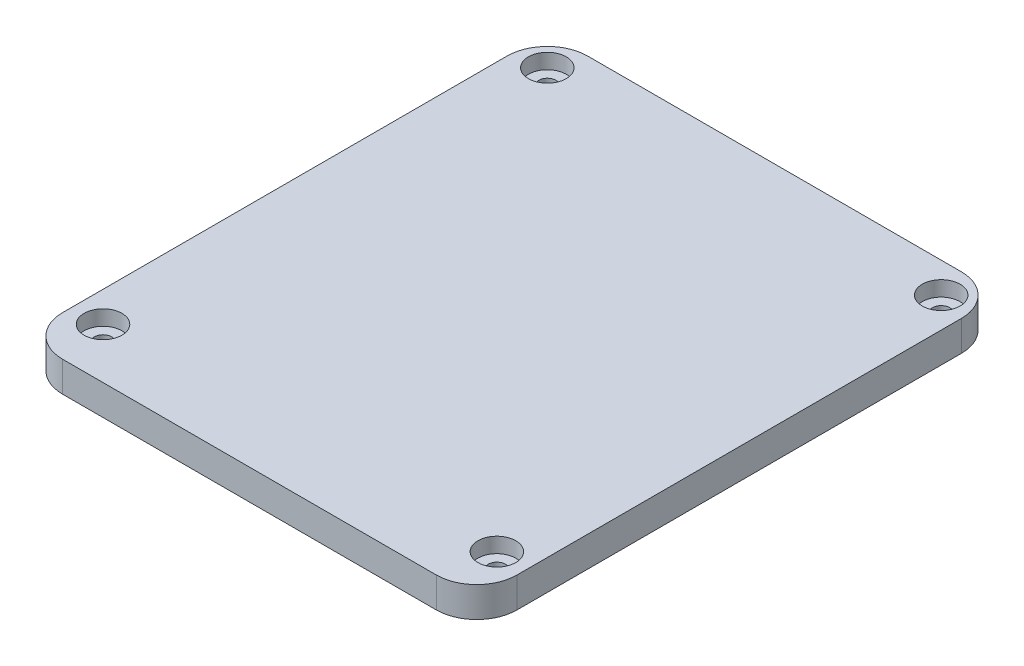
ISO-10303-21;
HEADER;
FILE_DESCRIPTION(('STEP AP214'),'2;1');
FILE_NAME('part.step','',(''),(''),'','','');
FILE_SCHEMA(('AUTOMOTIVE_DESIGN { 1 0 10303 214 1 1 1 1 }'));
ENDSEC;
DATA;
#1=APPLICATION_CONTEXT('core data for automotive mechanical design processes');
#2=APPLICATION_PROTOCOL_DEFINITION('international standard','automotive_design',2000,#1);
#3=PRODUCT_CONTEXT('',#1,'mechanical');
#4=PRODUCT('Part','Part','',(#3));
#5=PRODUCT_RELATED_PRODUCT_CATEGORY('part','',(#4));
#6=PRODUCT_DEFINITION_FORMATION('','',#4);
#7=PRODUCT_DEFINITION_CONTEXT('part definition',#1,'design');
#8=PRODUCT_DEFINITION('design','',#6,#7);
#9=PRODUCT_DEFINITION_SHAPE('','',#8);
#10=(LENGTH_UNIT() NAMED_UNIT(*) SI_UNIT(.MILLI.,.METRE.));
#11=(NAMED_UNIT(*) PLANE_ANGLE_UNIT() SI_UNIT($,.RADIAN.));
#12=(NAMED_UNIT(*) SI_UNIT($,.STERADIAN.) SOLID_ANGLE_UNIT());
#13=UNCERTAINTY_MEASURE_WITH_UNIT(LENGTH_MEASURE(1.E-05),#10,'distance_accuracy_value','');
#14=(GEOMETRIC_REPRESENTATION_CONTEXT(3) GLOBAL_UNCERTAINTY_ASSIGNED_CONTEXT((#13)) GLOBAL_UNIT_ASSIGNED_CONTEXT((#10,
#11,#12)) REPRESENTATION_CONTEXT('',''));
#15=CARTESIAN_POINT('',(0.,0.,0.));
#16=DIRECTION('',(0.,0.,1.));
#17=DIRECTION('',(1.,0.,0.));
#18=AXIS2_PLACEMENT_3D('',#15,#16,#17);
#19=CARTESIAN_POINT('',(0.,3.,0.));
#20=DIRECTION('',(0.,1.,0.));
#21=DIRECTION('',(0.,0.,1.));
#22=AXIS2_PLACEMENT_3D('',#19,#20,#21);
#23=PLANE('',#22);
#24=CARTESIAN_POINT('',(-39.,3.,-44.));
#25=DIRECTION('',(0.,1.,0.));
#26=DIRECTION('',(0.,0.,1.));
#27=AXIS2_PLACEMENT_3D('',#24,#25,#26);
#28=CIRCLE('',#27,1.7);
#29=CARTESIAN_POINT('',(-39.,3.,-42.3));
#30=VERTEX_POINT('',#29);
#31=EDGE_CURVE('E240',#30,#30,#28,.T.);
#32=ORIENTED_EDGE('',*,*,#31,.F.);
#33=EDGE_LOOP('',(#32));
#34=FACE_BOUND('',#33,.T.);
#35=CARTESIAN_POINT('',(-39.,3.,-44.));
#36=DIRECTION('',(0.,1.,0.));
#37=DIRECTION('',(0.,0.,1.));
#38=AXIS2_PLACEMENT_3D('',#35,#36,#37);
#39=CIRCLE('',#38,3.75);
#40=CARTESIAN_POINT('',(-39.,3.,-40.25));
#41=VERTEX_POINT('',#40);
#42=EDGE_CURVE('E291',#41,#41,#39,.F.);
#43=ORIENTED_EDGE('',*,*,#42,.F.);
#44=EDGE_LOOP('',(#43));
#45=FACE_BOUND('',#44,.T.);
#46=ADVANCED_FACE('F37',(#34,#45),#23,.T.);
#47=CARTESIAN_POINT('',(39.,3.,-44.));
#48=DIRECTION('',(0.,1.,0.));
#49=DIRECTION('',(0.,0.,1.));
#50=AXIS2_PLACEMENT_3D('',#47,#48,#49);
#51=CIRCLE('',#50,1.7);
#52=CARTESIAN_POINT('',(39.,3.,-42.3));
#53=VERTEX_POINT('',#52);
#54=EDGE_CURVE('E241',#53,#53,#51,.T.);
#55=ORIENTED_EDGE('',*,*,#54,.F.);
#56=EDGE_LOOP('',(#55));
#57=FACE_BOUND('',#56,.T.);
#58=CARTESIAN_POINT('',(39.,3.,-44.));
#59=DIRECTION('',(0.,1.,0.));
#60=DIRECTION('',(0.,0.,1.));
#61=AXIS2_PLACEMENT_3D('',#58,#59,#60);
#62=CIRCLE('',#61,3.75000000000001);
#63=CARTESIAN_POINT('',(39.,3.,-40.25));
#64=VERTEX_POINT('',#63);
#65=EDGE_CURVE('E288',#64,#64,#62,.F.);
#66=ORIENTED_EDGE('',*,*,#65,.F.);
#67=EDGE_LOOP('',(#66));
#68=FACE_BOUND('',#67,.T.);
#69=ADVANCED_FACE('F486',(#57,#68),#23,.T.);
#70=CARTESIAN_POINT('',(-39.,3.,44.));
#71=DIRECTION('',(0.,1.,0.));
#72=DIRECTION('',(0.,0.,1.));
#73=AXIS2_PLACEMENT_3D('',#70,#71,#72);
#74=CIRCLE('',#73,1.7);
#75=CARTESIAN_POINT('',(-39.,3.,45.7));
#76=VERTEX_POINT('',#75);
#77=EDGE_CURVE('E253',#76,#76,#74,.T.);
#78=ORIENTED_EDGE('',*,*,#77,.F.);
#79=EDGE_LOOP('',(#78));
#80=FACE_BOUND('',#79,.T.);
#81=CARTESIAN_POINT('',(-39.,3.,44.));
#82=DIRECTION('',(0.,1.,0.));
#83=DIRECTION('',(0.,0.,1.));
#84=AXIS2_PLACEMENT_3D('',#81,#82,#83);
#85=CIRCLE('',#84,3.75);
#86=CARTESIAN_POINT('',(-39.,3.,47.75));
#87=VERTEX_POINT('',#86);
#88=EDGE_CURVE('E285',#87,#87,#85,.F.);
#89=ORIENTED_EDGE('',*,*,#88,.F.);
#90=EDGE_LOOP('',(#89));
#91=FACE_BOUND('',#90,.T.);
#92=ADVANCED_FACE('F493',(#80,#91),#23,.T.);
#93=CARTESIAN_POINT('',(39.,3.,44.));
#94=DIRECTION('',(0.,1.,0.));
#95=DIRECTION('',(0.,0.,1.));
#96=AXIS2_PLACEMENT_3D('',#93,#94,#95);
#97=CIRCLE('',#96,1.7);
#98=CARTESIAN_POINT('',(39.,3.,45.7));
#99=VERTEX_POINT('',#98);
#100=EDGE_CURVE('E247',#99,#99,#97,.T.);
#101=ORIENTED_EDGE('',*,*,#100,.F.);
#102=EDGE_LOOP('',(#101));
#103=FACE_BOUND('',#102,.T.);
#104=CARTESIAN_POINT('',(39.,3.,44.));
#105=DIRECTION('',(0.,1.,0.));
#106=DIRECTION('',(0.,0.,1.));
#107=AXIS2_PLACEMENT_3D('',#104,#105,#106);
#108=CIRCLE('',#107,3.75000000000001);
#109=CARTESIAN_POINT('',(39.,3.,47.75));
#110=VERTEX_POINT('',#109);
#111=EDGE_CURVE('E282',#110,#110,#108,.F.);
#112=ORIENTED_EDGE('',*,*,#111,.F.);
#113=EDGE_LOOP('',(#112));
#114=FACE_BOUND('',#113,.T.);
#115=ADVANCED_FACE('F489',(#103,#114),#23,.T.);
#116=CARTESIAN_POINT('',(0.,-2.,0.));
#117=DIRECTION('',(0.,1.,0.));
#118=DIRECTION('',(0.,0.,1.));
#119=AXIS2_PLACEMENT_3D('',#116,#117,#118);
#120=PLANE('',#119);
#121=DIRECTION('',(-1.,0.,0.));
#122=VECTOR('',#121,1.);
#123=CARTESIAN_POINT('',(41.6,-2.,46.6));
#124=LINE('',#123,#122);
#125=CARTESIAN_POINT('',(33.5925976661617,-2.,46.6));
#126=VERTEX_POINT('',#125);
#127=CARTESIAN_POINT('',(-33.5925976661617,-2.,46.6));
#128=VERTEX_POINT('',#127);
#129=EDGE_CURVE('E256',#126,#128,#124,.T.);
#130=ORIENTED_EDGE('',*,*,#129,.T.);
#131=CARTESIAN_POINT('',(-39.,-2.,44.));
#132=DIRECTION('',(0.,1.,0.));
#133=DIRECTION('',(0.,0.,1.));
#134=AXIS2_PLACEMENT_3D('',#131,#132,#133);
#135=CIRCLE('',#134,5.99999999999997);
#136=CARTESIAN_POINT('',(-33.0133481811617,-2.,43.6));
#137=VERTEX_POINT('',#136);
#138=EDGE_CURVE('E360',#128,#137,#135,.T.);
#139=ORIENTED_EDGE('',*,*,#138,.T.);
#140=DIRECTION('',(-1.,0.,0.));
#141=VECTOR('',#140,1.);
#142=CARTESIAN_POINT('',(38.6,-2.,43.6));
#143=LINE('',#142,#141);
#144=CARTESIAN_POINT('',(33.0133481811617,-2.,43.6));
#145=VERTEX_POINT('',#144);
#146=EDGE_CURVE('E233',#145,#137,#143,.T.);
#147=ORIENTED_EDGE('',*,*,#146,.F.);
#148=CARTESIAN_POINT('',(39.,-2.,44.));
#149=DIRECTION('',(0.,1.,0.));
#150=DIRECTION('',(0.,0.,1.));
#151=AXIS2_PLACEMENT_3D('',#148,#149,#150);
#152=CIRCLE('',#151,5.99999999999997);
#153=EDGE_CURVE('E220',#145,#126,#152,.T.);
#154=ORIENTED_EDGE('',*,*,#153,.T.);
#155=EDGE_LOOP('',(#130,#139,#147,#154));
#156=FACE_BOUND('',#155,.T.);
#157=ADVANCED_FACE('F470',(#156),#120,.F.);
#158=DIRECTION('',(0.,0.,1.));
#159=VECTOR('',#158,1.);
#160=CARTESIAN_POINT('',(41.6,-2.,46.6));
#161=LINE('',#160,#159);
#162=CARTESIAN_POINT('',(41.6,-2.,-38.5925976661617));
#163=VERTEX_POINT('',#162);
#164=CARTESIAN_POINT('',(41.6,-2.,38.5925976661617));
#165=VERTEX_POINT('',#164);
#166=EDGE_CURVE('E431',#163,#165,#161,.T.);
#167=ORIENTED_EDGE('',*,*,#166,.T.);
#168=CARTESIAN_POINT('',(38.6,-2.,38.0133481811617));
#169=VERTEX_POINT('',#168);
#170=EDGE_CURVE('E204',#165,#169,#152,.T.);
#171=ORIENTED_EDGE('',*,*,#170,.T.);
#172=DIRECTION('',(0.,0.,1.));
#173=VECTOR('',#172,1.);
#174=CARTESIAN_POINT('',(38.6,-2.,43.6));
#175=LINE('',#174,#173);
#176=CARTESIAN_POINT('',(38.6,-2.,-38.0133481811617));
#177=VERTEX_POINT('',#176);
#178=EDGE_CURVE('E415',#177,#169,#175,.T.);
#179=ORIENTED_EDGE('',*,*,#178,.F.);
#180=CARTESIAN_POINT('',(39.,-2.,-44.));
#181=DIRECTION('',(0.,1.,0.));
#182=DIRECTION('',(0.,0.,1.));
#183=AXIS2_PLACEMENT_3D('',#180,#181,#182);
#184=CIRCLE('',#183,5.99999999999997);
#185=EDGE_CURVE('E370',#177,#163,#184,.T.);
#186=ORIENTED_EDGE('',*,*,#185,.T.);
#187=EDGE_LOOP('',(#167,#171,#179,#186));
#188=FACE_BOUND('',#187,.T.);
#189=ADVANCED_FACE('F505',(#188),#120,.F.);
#190=DIRECTION('',(1.,0.,0.));
#191=VECTOR('',#190,1.);
#192=CARTESIAN_POINT('',(41.6,-2.,-46.6));
#193=LINE('',#192,#191);
#194=CARTESIAN_POINT('',(-33.5925976661617,-2.,-46.6));
#195=VERTEX_POINT('',#194);
#196=CARTESIAN_POINT('',(33.5925976661617,-2.,-46.6));
#197=VERTEX_POINT('',#196);
#198=EDGE_CURVE('E428',#195,#197,#193,.T.);
#199=ORIENTED_EDGE('',*,*,#198,.T.);
#200=CARTESIAN_POINT('',(33.0133481811617,-2.,-43.6));
#201=VERTEX_POINT('',#200);
#202=EDGE_CURVE('E369',#197,#201,#184,.T.);
#203=ORIENTED_EDGE('',*,*,#202,.T.);
#204=DIRECTION('',(1.,0.,0.));
#205=VECTOR('',#204,1.);
#206=CARTESIAN_POINT('',(38.6,-2.,-43.6));
#207=LINE('',#206,#205);
#208=CARTESIAN_POINT('',(-33.0133481811617,-2.,-43.6));
#209=VERTEX_POINT('',#208);
#210=EDGE_CURVE('E411',#209,#201,#207,.T.);
#211=ORIENTED_EDGE('',*,*,#210,.F.);
#212=CARTESIAN_POINT('',(-39.,-2.,-44.));
#213=DIRECTION('',(0.,1.,0.));
#214=DIRECTION('',(0.,0.,1.));
#215=AXIS2_PLACEMENT_3D('',#212,#213,#214);
#216=CIRCLE('',#215,5.99999999999997);
#217=EDGE_CURVE('E395',#209,#195,#216,.T.);
#218=ORIENTED_EDGE('',*,*,#217,.T.);
#219=EDGE_LOOP('',(#199,#203,#211,#218));
#220=FACE_BOUND('',#219,.T.);
#221=ADVANCED_FACE('F563',(#220),#120,.F.);
#222=CARTESIAN_POINT('',(-45.,3.,50.));
#223=DIRECTION('',(1.,0.,0.));
#224=DIRECTION('',(0.,0.,-1.));
#225=AXIS2_PLACEMENT_3D('',#222,#223,#224);
#226=PLANE('',#225);
#227=DIRECTION('',(0.,0.,1.));
#228=VECTOR('',#227,1.);
#229=CARTESIAN_POINT('',(-45.,0.,50.));
#230=LINE('',#229,#228);
#231=CARTESIAN_POINT('',(-45.,0.,-42.));
#232=VERTEX_POINT('',#231);
#233=CARTESIAN_POINT('',(-45.,0.,46.));
#234=VERTEX_POINT('',#233);
#235=EDGE_CURVE('E260',#232,#234,#230,.T.);
#236=ORIENTED_EDGE('',*,*,#235,.T.);
#237=DIRECTION('',(0.,-1.,0.));
#238=VECTOR('',#237,1.);
#239=CARTESIAN_POINT('',(-45.,6.,46.));
#240=LINE('',#239,#238);
#241=CARTESIAN_POINT('',(-45.,6.,46.));
#242=VERTEX_POINT('',#241);
#243=EDGE_CURVE('E311',#234,#242,#240,.F.);
#244=ORIENTED_EDGE('',*,*,#243,.T.);
#245=DIRECTION('',(0.,0.,1.));
#246=VECTOR('',#245,1.);
#247=CARTESIAN_POINT('',(-45.,6.,50.));
#248=LINE('',#247,#246);
#249=CARTESIAN_POINT('',(-45.,6.,-42.));
#250=VERTEX_POINT('',#249);
#251=EDGE_CURVE('E349',#250,#242,#248,.T.);
#252=ORIENTED_EDGE('',*,*,#251,.F.);
#253=DIRECTION('',(0.,-1.,0.));
#254=VECTOR('',#253,1.);
#255=CARTESIAN_POINT('',(-45.,3.,-42.));
#256=LINE('',#255,#254);
#257=EDGE_CURVE('E308',#250,#232,#256,.T.);
#258=ORIENTED_EDGE('',*,*,#257,.T.);
#259=EDGE_LOOP('',(#236,#244,#252,#258));
#260=FACE_BOUND('',#259,.T.);
#261=ADVANCED_FACE('F573',(#260),#226,.F.);
#262=CARTESIAN_POINT('',(45.,3.,50.));
#263=DIRECTION('',(-1.,0.,0.));
#264=DIRECTION('',(0.,0.,1.));
#265=AXIS2_PLACEMENT_3D('',#262,#263,#264);
#266=PLANE('',#265);
#267=DIRECTION('',(0.,0.,-1.));
#268=VECTOR('',#267,1.);
#269=CARTESIAN_POINT('',(45.,6.,54.));
#270=LINE('',#269,#268);
#271=CARTESIAN_POINT('',(45.,6.,46.));
#272=VERTEX_POINT('',#271);
#273=CARTESIAN_POINT('',(45.,6.,-42.));
#274=VERTEX_POINT('',#273);
#275=EDGE_CURVE('E329',#272,#274,#270,.T.);
#276=ORIENTED_EDGE('',*,*,#275,.F.);
#277=DIRECTION('',(0.,1.,0.));
#278=VECTOR('',#277,1.);
#279=CARTESIAN_POINT('',(45.,0.,46.));
#280=LINE('',#279,#278);
#281=CARTESIAN_POINT('',(45.,0.,46.));
#282=VERTEX_POINT('',#281);
#283=EDGE_CURVE('E322',#272,#282,#280,.F.);
#284=ORIENTED_EDGE('',*,*,#283,.T.);
#285=DIRECTION('',(0.,0.,-1.));
#286=VECTOR('',#285,1.);
#287=CARTESIAN_POINT('',(45.,0.,50.));
#288=LINE('',#287,#286);
#289=CARTESIAN_POINT('',(45.,0.,-42.));
#290=VERTEX_POINT('',#289);
#291=EDGE_CURVE('E265',#282,#290,#288,.T.);
#292=ORIENTED_EDGE('',*,*,#291,.T.);
#293=DIRECTION('',(0.,-1.,0.));
#294=VECTOR('',#293,1.);
#295=CARTESIAN_POINT('',(45.,3.,-42.));
#296=LINE('',#295,#294);
#297=EDGE_CURVE('E320',#290,#274,#296,.F.);
#298=ORIENTED_EDGE('',*,*,#297,.T.);
#299=EDGE_LOOP('',(#276,#284,#292,#298));
#300=FACE_BOUND('',#299,.T.);
#301=ADVANCED_FACE('F327',(#300),#266,.F.);
#302=CARTESIAN_POINT('',(45.,3.,-50.));
#303=DIRECTION('',(0.,0.,1.));
#304=DIRECTION('',(1.,0.,0.));
#305=AXIS2_PLACEMENT_3D('',#302,#303,#304);
#306=PLANE('',#305);
#307=DIRECTION('',(-1.,0.,0.));
#308=VECTOR('',#307,1.);
#309=CARTESIAN_POINT('',(45.,6.,-50.));
#310=LINE('',#309,#308);
#311=CARTESIAN_POINT('',(37.,6.,-50.));
#312=VERTEX_POINT('',#311);
#313=CARTESIAN_POINT('',(-37.,6.,-50.));
#314=VERTEX_POINT('',#313);
#315=EDGE_CURVE('E351',#312,#314,#310,.T.);
#316=ORIENTED_EDGE('',*,*,#315,.F.);
#317=DIRECTION('',(0.,-1.,0.));
#318=VECTOR('',#317,1.);
#319=CARTESIAN_POINT('',(37.,3.,-50.));
#320=LINE('',#319,#318);
#321=CARTESIAN_POINT('',(37.,0.,-50.));
#322=VERTEX_POINT('',#321);
#323=EDGE_CURVE('E11',#312,#322,#320,.T.);
#324=ORIENTED_EDGE('',*,*,#323,.T.);
#325=DIRECTION('',(-1.,0.,0.));
#326=VECTOR('',#325,1.);
#327=CARTESIAN_POINT('',(45.,0.,-50.));
#328=LINE('',#327,#326);
#329=CARTESIAN_POINT('',(-37.,0.,-50.));
#330=VERTEX_POINT('',#329);
#331=EDGE_CURVE('E268',#322,#330,#328,.T.);
#332=ORIENTED_EDGE('',*,*,#331,.T.);
#333=DIRECTION('',(0.,-1.,0.));
#334=VECTOR('',#333,1.);
#335=CARTESIAN_POINT('',(-37.,3.,-50.));
#336=LINE('',#335,#334);
#337=EDGE_CURVE('E45',#330,#314,#336,.F.);
#338=ORIENTED_EDGE('',*,*,#337,.T.);
#339=EDGE_LOOP('',(#316,#324,#332,#338));
#340=FACE_BOUND('',#339,.T.);
#341=ADVANCED_FACE('F671',(#340),#306,.F.);
#342=CARTESIAN_POINT('',(0.,0.,0.));
#343=DIRECTION('',(0.,1.,0.));
#344=DIRECTION('',(0.,0.,1.));
#345=AXIS2_PLACEMENT_3D('',#342,#343,#344);
#346=PLANE('',#345);
#347=CARTESIAN_POINT('',(-39.,0.,44.));
#348=DIRECTION('',(0.,1.,0.));
#349=DIRECTION('',(0.,0.,1.));
#350=AXIS2_PLACEMENT_3D('',#347,#348,#349);
#351=CIRCLE('',#350,5.99999999999997);
#352=CARTESIAN_POINT('',(-33.5925976661617,0.,46.6));
#353=VERTEX_POINT('',#352);
#354=CARTESIAN_POINT('',(-33.0133481811617,0.,43.6));
#355=VERTEX_POINT('',#354);
#356=EDGE_CURVE('E367',#353,#355,#351,.T.);
#357=ORIENTED_EDGE('',*,*,#356,.F.);
#358=DIRECTION('',(-1.,0.,0.));
#359=VECTOR('',#358,1.);
#360=CARTESIAN_POINT('',(41.6,0.,46.6));
#361=LINE('',#360,#359);
#362=CARTESIAN_POINT('',(33.5925976661617,0.,46.6));
#363=VERTEX_POINT('',#362);
#364=EDGE_CURVE('E226',#363,#353,#361,.T.);
#365=ORIENTED_EDGE('',*,*,#364,.F.);
#366=CARTESIAN_POINT('',(39.,0.,44.));
#367=DIRECTION('',(0.,1.,0.));
#368=DIRECTION('',(0.,0.,1.));
#369=AXIS2_PLACEMENT_3D('',#366,#367,#368);
#370=CIRCLE('',#369,5.99999999999997);
#371=CARTESIAN_POINT('',(33.0133481811617,0.,43.6));
#372=VERTEX_POINT('',#371);
#373=EDGE_CURVE('E221',#372,#363,#370,.T.);
#374=ORIENTED_EDGE('',*,*,#373,.F.);
#375=DIRECTION('',(-1.,0.,0.));
#376=VECTOR('',#375,1.);
#377=CARTESIAN_POINT('',(38.6,0.,43.6));
#378=LINE('',#377,#376);
#379=EDGE_CURVE('E424',#372,#355,#378,.T.);
#380=ORIENTED_EDGE('',*,*,#379,.T.);
#381=EDGE_LOOP('',(#357,#365,#374,#380));
#382=FACE_BOUND('',#381,.T.);
#383=CARTESIAN_POINT('',(-36.6,0.,38.500909166053));
#384=VERTEX_POINT('',#383);
#385=CARTESIAN_POINT('',(-39.6,0.,38.0300753773603));
#386=VERTEX_POINT('',#385);
#387=EDGE_CURVE('E365',#384,#386,#351,.T.);
#388=ORIENTED_EDGE('',*,*,#387,.F.);
#389=DIRECTION('',(0.,0.,-1.));
#390=VECTOR('',#389,1.);
#391=CARTESIAN_POINT('',(-36.6,0.,43.6));
#392=LINE('',#391,#390);
#393=CARTESIAN_POINT('',(-36.6,0.,-38.500909166053));
#394=VERTEX_POINT('',#393);
#395=EDGE_CURVE('E408',#384,#394,#392,.T.);
#396=ORIENTED_EDGE('',*,*,#395,.T.);
#397=CARTESIAN_POINT('',(-39.,0.,-44.));
#398=DIRECTION('',(0.,1.,0.));
#399=DIRECTION('',(0.,0.,1.));
#400=AXIS2_PLACEMENT_3D('',#397,#398,#399);
#401=CIRCLE('',#400,5.99999999999997);
#402=CARTESIAN_POINT('',(-39.6,0.,-38.0300753773603));
#403=VERTEX_POINT('',#402);
#404=EDGE_CURVE('E391',#403,#394,#401,.T.);
#405=ORIENTED_EDGE('',*,*,#404,.F.);
#406=DIRECTION('',(0.,0.,-1.));
#407=VECTOR('',#406,1.);
#408=CARTESIAN_POINT('',(-39.6,0.,46.6));
#409=LINE('',#408,#407);
#410=EDGE_CURVE('E274',#386,#403,#409,.T.);
#411=ORIENTED_EDGE('',*,*,#410,.F.);
#412=EDGE_LOOP('',(#388,#396,#405,#411));
#413=FACE_BOUND('',#412,.T.);
#414=CARTESIAN_POINT('',(41.6,0.,38.5925976661617));
#415=VERTEX_POINT('',#414);
#416=CARTESIAN_POINT('',(38.6,0.,38.0133481811617));
#417=VERTEX_POINT('',#416);
#418=EDGE_CURVE('E201',#415,#417,#370,.T.);
#419=ORIENTED_EDGE('',*,*,#418,.F.);
#420=DIRECTION('',(0.,0.,1.));
#421=VECTOR('',#420,1.);
#422=CARTESIAN_POINT('',(41.6,0.,46.6));
#423=LINE('',#422,#421);
#424=CARTESIAN_POINT('',(41.6,0.,-38.5925976661617));
#425=VERTEX_POINT('',#424);
#426=EDGE_CURVE('E217',#425,#415,#423,.T.);
#427=ORIENTED_EDGE('',*,*,#426,.F.);
#428=CARTESIAN_POINT('',(39.,0.,-44.));
#429=DIRECTION('',(0.,1.,0.));
#430=DIRECTION('',(0.,0.,1.));
#431=AXIS2_PLACEMENT_3D('',#428,#429,#430);
#432=CIRCLE('',#431,5.99999999999997);
#433=CARTESIAN_POINT('',(38.6,0.,-38.0133481811617));
#434=VERTEX_POINT('',#433);
#435=EDGE_CURVE('E359',#434,#425,#432,.T.);
#436=ORIENTED_EDGE('',*,*,#435,.F.);
#437=DIRECTION('',(0.,0.,1.));
#438=VECTOR('',#437,1.);
#439=CARTESIAN_POINT('',(38.6,0.,43.6));
#440=LINE('',#439,#438);
#441=EDGE_CURVE('E219',#434,#417,#440,.T.);
#442=ORIENTED_EDGE('',*,*,#441,.T.);
#443=EDGE_LOOP('',(#419,#427,#436,#442));
#444=FACE_BOUND('',#443,.T.);
#445=DIRECTION('',(1.,0.,0.));
#446=VECTOR('',#445,1.);
#447=CARTESIAN_POINT('',(-45.,0.,54.));
#448=LINE('',#447,#446);
#449=CARTESIAN_POINT('',(-37.,0.,54.));
#450=VERTEX_POINT('',#449);
#451=CARTESIAN_POINT('',(37.,0.,54.));
#452=VERTEX_POINT('',#451);
#453=EDGE_CURVE('E344',#450,#452,#448,.T.);
#454=ORIENTED_EDGE('',*,*,#453,.F.);
#455=CARTESIAN_POINT('',(-37.,0.,46.));
#456=DIRECTION('',(0.,1.,0.));
#457=DIRECTION('',(0.,0.,1.));
#458=AXIS2_PLACEMENT_3D('',#455,#456,#457);
#459=CIRCLE('',#458,8.);
#460=EDGE_CURVE('E306',#450,#234,#459,.F.);
#461=ORIENTED_EDGE('',*,*,#460,.T.);
#462=ORIENTED_EDGE('',*,*,#235,.F.);
#463=CARTESIAN_POINT('',(-37.,0.,-42.));
#464=DIRECTION('',(0.,1.,0.));
#465=DIRECTION('',(0.,0.,1.));
#466=AXIS2_PLACEMENT_3D('',#463,#464,#465);
#467=CIRCLE('',#466,8.);
#468=EDGE_CURVE('E300',#232,#330,#467,.F.);
#469=ORIENTED_EDGE('',*,*,#468,.T.);
#470=ORIENTED_EDGE('',*,*,#331,.F.);
#471=CARTESIAN_POINT('',(37.,0.,-42.));
#472=DIRECTION('',(0.,1.,0.));
#473=DIRECTION('',(0.,0.,1.));
#474=AXIS2_PLACEMENT_3D('',#471,#472,#473);
#475=CIRCLE('',#474,8.);
#476=EDGE_CURVE('E302',#322,#290,#475,.F.);
#477=ORIENTED_EDGE('',*,*,#476,.T.);
#478=ORIENTED_EDGE('',*,*,#291,.F.);
#479=CARTESIAN_POINT('',(37.,0.,46.));
#480=DIRECTION('',(0.,1.,0.));
#481=DIRECTION('',(0.,0.,1.));
#482=AXIS2_PLACEMENT_3D('',#479,#480,#481);
#483=CIRCLE('',#482,8.);
#484=EDGE_CURVE('E304',#282,#452,#483,.F.);
#485=ORIENTED_EDGE('',*,*,#484,.T.);
#486=EDGE_LOOP('',(#454,#461,#462,#469,#470,#477,#478,#485));
#487=FACE_BOUND('',#486,.T.);
#488=CARTESIAN_POINT('',(33.5925976661617,0.,-46.6));
#489=VERTEX_POINT('',#488);
#490=CARTESIAN_POINT('',(33.0133481811617,0.,-43.6));
#491=VERTEX_POINT('',#490);
#492=EDGE_CURVE('E373',#489,#491,#432,.T.);
#493=ORIENTED_EDGE('',*,*,#492,.F.);
#494=DIRECTION('',(1.,0.,0.));
#495=VECTOR('',#494,1.);
#496=CARTESIAN_POINT('',(41.6,0.,-46.6));
#497=LINE('',#496,#495);
#498=CARTESIAN_POINT('',(-33.5925976661617,0.,-46.6));
#499=VERTEX_POINT('',#498);
#500=EDGE_CURVE('E227',#499,#489,#497,.T.);
#501=ORIENTED_EDGE('',*,*,#500,.F.);
#502=CARTESIAN_POINT('',(-33.0133481811617,0.,-43.6));
#503=VERTEX_POINT('',#502);
#504=EDGE_CURVE('E396',#503,#499,#401,.T.);
#505=ORIENTED_EDGE('',*,*,#504,.F.);
#506=DIRECTION('',(1.,0.,0.));
#507=VECTOR('',#506,1.);
#508=CARTESIAN_POINT('',(38.6,0.,-43.6));
#509=LINE('',#508,#507);
#510=EDGE_CURVE('E412',#503,#491,#509,.T.);
#511=ORIENTED_EDGE('',*,*,#510,.T.);
#512=EDGE_LOOP('',(#493,#501,#505,#511));
#513=FACE_BOUND('',#512,.T.);
#514=CARTESIAN_POINT('',(39.,0.,-44.));
#515=DIRECTION('',(0.,1.,0.));
#516=DIRECTION('',(0.,0.,1.));
#517=AXIS2_PLACEMENT_3D('',#514,#515,#516);
#518=CIRCLE('',#517,1.7);
#519=CARTESIAN_POINT('',(39.,0.,-42.3));
#520=VERTEX_POINT('',#519);
#521=EDGE_CURVE('E237',#520,#520,#518,.T.);
#522=ORIENTED_EDGE('',*,*,#521,.T.);
#523=EDGE_LOOP('',(#522));
#524=FACE_BOUND('',#523,.T.);
#525=CARTESIAN_POINT('',(-39.,0.,-44.));
#526=DIRECTION('',(0.,1.,0.));
#527=DIRECTION('',(0.,0.,1.));
#528=AXIS2_PLACEMENT_3D('',#525,#526,#527);
#529=CIRCLE('',#528,1.7);
#530=CARTESIAN_POINT('',(-39.,0.,-42.3));
#531=VERTEX_POINT('',#530);
#532=EDGE_CURVE('E257',#531,#531,#529,.T.);
#533=ORIENTED_EDGE('',*,*,#532,.T.);
#534=EDGE_LOOP('',(#533));
#535=FACE_BOUND('',#534,.T.);
#536=CARTESIAN_POINT('',(39.,0.,44.));
#537=DIRECTION('',(0.,1.,0.));
#538=DIRECTION('',(0.,0.,1.));
#539=AXIS2_PLACEMENT_3D('',#536,#537,#538);
#540=CIRCLE('',#539,1.7);
#541=CARTESIAN_POINT('',(39.,0.,45.7));
#542=VERTEX_POINT('',#541);
#543=EDGE_CURVE('E244',#542,#542,#540,.T.);
#544=ORIENTED_EDGE('',*,*,#543,.T.);
#545=EDGE_LOOP('',(#544));
#546=FACE_BOUND('',#545,.T.);
#547=CARTESIAN_POINT('',(-39.,0.,44.));
#548=DIRECTION('',(0.,1.,0.));
#549=DIRECTION('',(0.,0.,1.));
#550=AXIS2_PLACEMENT_3D('',#547,#548,#549);
#551=CIRCLE('',#550,1.7);
#552=CARTESIAN_POINT('',(-39.,0.,45.7));
#553=VERTEX_POINT('',#552);
#554=EDGE_CURVE('E250',#553,#553,#551,.T.);
#555=ORIENTED_EDGE('',*,*,#554,.T.);
#556=EDGE_LOOP('',(#555));
#557=FACE_BOUND('',#556,.T.);
#558=ADVANCED_FACE('F215',(#382,#413,#444,#487,#513,#524,#535,#546,#557),#346,.F.);
#559=CARTESIAN_POINT('',(-39.,0.,-44.));
#560=DIRECTION('',(0.,1.,0.));
#561=DIRECTION('',(0.,0.,1.));
#562=AXIS2_PLACEMENT_3D('',#559,#560,#561);
#563=CYLINDRICAL_SURFACE('',#562,1.7);
#564=ORIENTED_EDGE('',*,*,#532,.F.);
#565=EDGE_LOOP('',(#564));
#566=FACE_BOUND('',#565,.T.);
#567=ORIENTED_EDGE('',*,*,#31,.T.);
#568=EDGE_LOOP('',(#567));
#569=FACE_BOUND('',#568,.T.);
#570=ADVANCED_FACE('F687',(#566,#569),#563,.F.);
#571=CARTESIAN_POINT('',(-39.,0.,44.));
#572=DIRECTION('',(0.,1.,0.));
#573=DIRECTION('',(0.,0.,1.));
#574=AXIS2_PLACEMENT_3D('',#571,#572,#573);
#575=CYLINDRICAL_SURFACE('',#574,1.7);
#576=ORIENTED_EDGE('',*,*,#554,.F.);
#577=EDGE_LOOP('',(#576));
#578=FACE_BOUND('',#577,.T.);
#579=ORIENTED_EDGE('',*,*,#77,.T.);
#580=EDGE_LOOP('',(#579));
#581=FACE_BOUND('',#580,.T.);
#582=ADVANCED_FACE('F698',(#578,#581),#575,.F.);
#583=CARTESIAN_POINT('',(39.,0.,44.));
#584=DIRECTION('',(0.,1.,0.));
#585=DIRECTION('',(0.,0.,1.));
#586=AXIS2_PLACEMENT_3D('',#583,#584,#585);
#587=CYLINDRICAL_SURFACE('',#586,1.7);
#588=ORIENTED_EDGE('',*,*,#543,.F.);
#589=EDGE_LOOP('',(#588));
#590=FACE_BOUND('',#589,.T.);
#591=ORIENTED_EDGE('',*,*,#100,.T.);
#592=EDGE_LOOP('',(#591));
#593=FACE_BOUND('',#592,.T.);
#594=ADVANCED_FACE('F569',(#590,#593),#587,.F.);
#595=CARTESIAN_POINT('',(39.,0.,-44.));
#596=DIRECTION('',(0.,1.,0.));
#597=DIRECTION('',(0.,0.,1.));
#598=AXIS2_PLACEMENT_3D('',#595,#596,#597);
#599=CYLINDRICAL_SURFACE('',#598,1.7);
#600=ORIENTED_EDGE('',*,*,#521,.F.);
#601=EDGE_LOOP('',(#600));
#602=FACE_BOUND('',#601,.T.);
#603=ORIENTED_EDGE('',*,*,#54,.T.);
#604=EDGE_LOOP('',(#603));
#605=FACE_BOUND('',#604,.T.);
#606=ADVANCED_FACE('F562',(#602,#605),#599,.F.);
#607=DIRECTION('',(0.,0.,-1.));
#608=VECTOR('',#607,1.);
#609=CARTESIAN_POINT('',(-36.6,-2.,43.6));
#610=LINE('',#609,#608);
#611=CARTESIAN_POINT('',(-36.6,-2.,38.500909166053));
#612=VERTEX_POINT('',#611);
#613=CARTESIAN_POINT('',(-36.6,-2.,-38.500909166053));
#614=VERTEX_POINT('',#613);
#615=EDGE_CURVE('E409',#612,#614,#610,.T.);
#616=ORIENTED_EDGE('',*,*,#615,.F.);
#617=CARTESIAN_POINT('',(-39.6,-2.,38.0300753773603));
#618=VERTEX_POINT('',#617);
#619=EDGE_CURVE('E364',#612,#618,#135,.T.);
#620=ORIENTED_EDGE('',*,*,#619,.T.);
#621=DIRECTION('',(0.,0.,-1.));
#622=VECTOR('',#621,1.);
#623=CARTESIAN_POINT('',(-39.6,-2.,46.6));
#624=LINE('',#623,#622);
#625=CARTESIAN_POINT('',(-39.6,-2.,-38.0300753773603));
#626=VERTEX_POINT('',#625);
#627=EDGE_CURVE('E230',#618,#626,#624,.T.);
#628=ORIENTED_EDGE('',*,*,#627,.T.);
#629=EDGE_CURVE('E392',#626,#614,#216,.T.);
#630=ORIENTED_EDGE('',*,*,#629,.T.);
#631=EDGE_LOOP('',(#616,#620,#628,#630));
#632=FACE_BOUND('',#631,.T.);
#633=ADVANCED_FACE('F452',(#632),#120,.F.);
#634=CARTESIAN_POINT('',(-39.6,-2.,46.6));
#635=DIRECTION('',(1.,0.,0.));
#636=DIRECTION('',(0.,0.,-1.));
#637=AXIS2_PLACEMENT_3D('',#634,#635,#636);
#638=PLANE('',#637);
#639=ORIENTED_EDGE('',*,*,#627,.F.);
#640=DIRECTION('',(0.,1.,0.));
#641=VECTOR('',#640,1.);
#642=CARTESIAN_POINT('',(-39.6,-2.,38.0300753773603));
#643=LINE('',#642,#641);
#644=EDGE_CURVE('E382',#618,#386,#643,.T.);
#645=ORIENTED_EDGE('',*,*,#644,.T.);
#646=ORIENTED_EDGE('',*,*,#410,.T.);
#647=DIRECTION('',(0.,1.,0.));
#648=VECTOR('',#647,1.);
#649=CARTESIAN_POINT('',(-39.6,-2.,-38.0300753773603));
#650=LINE('',#649,#648);
#651=EDGE_CURVE('E405',#403,#626,#650,.F.);
#652=ORIENTED_EDGE('',*,*,#651,.T.);
#653=EDGE_LOOP('',(#639,#645,#646,#652));
#654=FACE_BOUND('',#653,.T.);
#655=ADVANCED_FACE('F438',(#654),#638,.F.);
#656=CARTESIAN_POINT('',(41.6,-2.,-46.6));
#657=DIRECTION('',(0.,0.,1.));
#658=DIRECTION('',(1.,0.,0.));
#659=AXIS2_PLACEMENT_3D('',#656,#657,#658);
#660=PLANE('',#659);
#661=ORIENTED_EDGE('',*,*,#500,.T.);
#662=DIRECTION('',(0.,1.,0.));
#663=VECTOR('',#662,1.);
#664=CARTESIAN_POINT('',(33.5925976661617,-2.,-46.6));
#665=LINE('',#664,#663);
#666=EDGE_CURVE('E388',#489,#197,#665,.F.);
#667=ORIENTED_EDGE('',*,*,#666,.T.);
#668=ORIENTED_EDGE('',*,*,#198,.F.);
#669=DIRECTION('',(0.,1.,0.));
#670=VECTOR('',#669,1.);
#671=CARTESIAN_POINT('',(-33.5925976661617,-2.,-46.6));
#672=LINE('',#671,#670);
#673=EDGE_CURVE('E402',#195,#499,#672,.T.);
#674=ORIENTED_EDGE('',*,*,#673,.T.);
#675=EDGE_LOOP('',(#661,#667,#668,#674));
#676=FACE_BOUND('',#675,.T.);
#677=ADVANCED_FACE('F482',(#676),#660,.F.);
#678=CARTESIAN_POINT('',(41.6,-2.,46.6));
#679=DIRECTION('',(-1.,0.,0.));
#680=DIRECTION('',(0.,0.,1.));
#681=AXIS2_PLACEMENT_3D('',#678,#679,#680);
#682=PLANE('',#681);
#683=ORIENTED_EDGE('',*,*,#426,.T.);
#684=DIRECTION('',(0.,1.,0.));
#685=VECTOR('',#684,1.);
#686=CARTESIAN_POINT('',(41.6,-2.,38.5925976661617));
#687=LINE('',#686,#685);
#688=EDGE_CURVE('E198',#415,#165,#687,.F.);
#689=ORIENTED_EDGE('',*,*,#688,.T.);
#690=ORIENTED_EDGE('',*,*,#166,.F.);
#691=DIRECTION('',(0.,1.,0.));
#692=VECTOR('',#691,1.);
#693=CARTESIAN_POINT('',(41.6,-2.,-38.5925976661617));
#694=LINE('',#693,#692);
#695=EDGE_CURVE('E225',#163,#425,#694,.T.);
#696=ORIENTED_EDGE('',*,*,#695,.T.);
#697=EDGE_LOOP('',(#683,#689,#690,#696));
#698=FACE_BOUND('',#697,.T.);
#699=ADVANCED_FACE('F224',(#698),#682,.F.);
#700=CARTESIAN_POINT('',(41.6,-2.,46.6));
#701=DIRECTION('',(0.,0.,-1.));
#702=DIRECTION('',(-1.,0.,0.));
#703=AXIS2_PLACEMENT_3D('',#700,#701,#702);
#704=PLANE('',#703);
#705=ORIENTED_EDGE('',*,*,#364,.T.);
#706=DIRECTION('',(0.,1.,0.));
#707=VECTOR('',#706,1.);
#708=CARTESIAN_POINT('',(-33.5925976661617,-2.,46.6));
#709=LINE('',#708,#707);
#710=EDGE_CURVE('E379',#353,#128,#709,.F.);
#711=ORIENTED_EDGE('',*,*,#710,.T.);
#712=ORIENTED_EDGE('',*,*,#129,.F.);
#713=DIRECTION('',(0.,1.,0.));
#714=VECTOR('',#713,1.);
#715=CARTESIAN_POINT('',(33.5925976661617,-2.,46.6));
#716=LINE('',#715,#714);
#717=EDGE_CURVE('E210',#126,#363,#716,.T.);
#718=ORIENTED_EDGE('',*,*,#717,.T.);
#719=EDGE_LOOP('',(#705,#711,#712,#718));
#720=FACE_BOUND('',#719,.T.);
#721=ADVANCED_FACE('F473',(#720),#704,.F.);
#722=CARTESIAN_POINT('',(-36.6,-2.,43.6));
#723=DIRECTION('',(1.,0.,0.));
#724=DIRECTION('',(0.,0.,-1.));
#725=AXIS2_PLACEMENT_3D('',#722,#723,#724);
#726=PLANE('',#725);
#727=DIRECTION('',(0.,1.,0.));
#728=VECTOR('',#727,1.);
#729=CARTESIAN_POINT('',(-36.6,-2.,38.500909166053));
#730=LINE('',#729,#728);
#731=EDGE_CURVE('E209',#612,#384,#730,.T.);
#732=ORIENTED_EDGE('',*,*,#731,.F.);
#733=ORIENTED_EDGE('',*,*,#615,.T.);
#734=DIRECTION('',(0.,1.,0.));
#735=VECTOR('',#734,1.);
#736=CARTESIAN_POINT('',(-36.6,-2.,-38.500909166053));
#737=LINE('',#736,#735);
#738=EDGE_CURVE('E399',#394,#614,#737,.F.);
#739=ORIENTED_EDGE('',*,*,#738,.F.);
#740=ORIENTED_EDGE('',*,*,#395,.F.);
#741=EDGE_LOOP('',(#732,#733,#739,#740));
#742=FACE_BOUND('',#741,.T.);
#743=ADVANCED_FACE('F449',(#742),#726,.T.);
#744=CARTESIAN_POINT('',(38.6,-2.,-43.6));
#745=DIRECTION('',(0.,0.,1.));
#746=DIRECTION('',(1.,0.,0.));
#747=AXIS2_PLACEMENT_3D('',#744,#745,#746);
#748=PLANE('',#747);
#749=DIRECTION('',(0.,1.,0.));
#750=VECTOR('',#749,1.);
#751=CARTESIAN_POINT('',(33.0133481811617,-2.,-43.6));
#752=LINE('',#751,#750);
#753=EDGE_CURVE('E385',#491,#201,#752,.F.);
#754=ORIENTED_EDGE('',*,*,#753,.F.);
#755=ORIENTED_EDGE('',*,*,#510,.F.);
#756=DIRECTION('',(0.,1.,0.));
#757=VECTOR('',#756,1.);
#758=CARTESIAN_POINT('',(-33.0133481811617,-2.,-43.6));
#759=LINE('',#758,#757);
#760=EDGE_CURVE('E270',#209,#503,#759,.T.);
#761=ORIENTED_EDGE('',*,*,#760,.F.);
#762=ORIENTED_EDGE('',*,*,#210,.T.);
#763=EDGE_LOOP('',(#754,#755,#761,#762));
#764=FACE_BOUND('',#763,.T.);
#765=ADVANCED_FACE('F480',(#764),#748,.T.);
#766=CARTESIAN_POINT('',(38.6,-2.,43.6));
#767=DIRECTION('',(-1.,0.,0.));
#768=DIRECTION('',(0.,0.,1.));
#769=AXIS2_PLACEMENT_3D('',#766,#767,#768);
#770=PLANE('',#769);
#771=DIRECTION('',(0.,1.,0.));
#772=VECTOR('',#771,1.);
#773=CARTESIAN_POINT('',(38.6,-2.,38.0133481811617));
#774=LINE('',#773,#772);
#775=EDGE_CURVE('E363',#417,#169,#774,.F.);
#776=ORIENTED_EDGE('',*,*,#775,.F.);
#777=ORIENTED_EDGE('',*,*,#441,.F.);
#778=DIRECTION('',(0.,1.,0.));
#779=VECTOR('',#778,1.);
#780=CARTESIAN_POINT('',(38.6,-2.,-38.0133481811617));
#781=LINE('',#780,#779);
#782=EDGE_CURVE('E279',#177,#434,#781,.T.);
#783=ORIENTED_EDGE('',*,*,#782,.F.);
#784=ORIENTED_EDGE('',*,*,#178,.T.);
#785=EDGE_LOOP('',(#776,#777,#783,#784));
#786=FACE_BOUND('',#785,.T.);
#787=ADVANCED_FACE('F555',(#786),#770,.T.);
#788=CARTESIAN_POINT('',(38.6,-2.,43.6));
#789=DIRECTION('',(0.,0.,-1.));
#790=DIRECTION('',(-1.,0.,0.));
#791=AXIS2_PLACEMENT_3D('',#788,#789,#790);
#792=PLANE('',#791);
#793=DIRECTION('',(0.,1.,0.));
#794=VECTOR('',#793,1.);
#795=CARTESIAN_POINT('',(-33.0133481811617,-2.,43.6));
#796=LINE('',#795,#794);
#797=EDGE_CURVE('E277',#355,#137,#796,.F.);
#798=ORIENTED_EDGE('',*,*,#797,.F.);
#799=ORIENTED_EDGE('',*,*,#379,.F.);
#800=DIRECTION('',(0.,1.,0.));
#801=VECTOR('',#800,1.);
#802=CARTESIAN_POINT('',(33.0133481811617,-2.,43.6));
#803=LINE('',#802,#801);
#804=EDGE_CURVE('E273',#145,#372,#803,.T.);
#805=ORIENTED_EDGE('',*,*,#804,.F.);
#806=ORIENTED_EDGE('',*,*,#146,.T.);
#807=EDGE_LOOP('',(#798,#799,#805,#806));
#808=FACE_BOUND('',#807,.T.);
#809=ADVANCED_FACE('F463',(#808),#792,.T.);
#810=CARTESIAN_POINT('',(-39.,-2.,-44.));
#811=DIRECTION('',(0.,1.,0.));
#812=DIRECTION('',(0.,0.,1.));
#813=AXIS2_PLACEMENT_3D('',#810,#811,#812);
#814=CYLINDRICAL_SURFACE('',#813,5.99999999999997);
#815=ORIENTED_EDGE('',*,*,#404,.T.);
#816=ORIENTED_EDGE('',*,*,#738,.T.);
#817=ORIENTED_EDGE('',*,*,#629,.F.);
#818=ORIENTED_EDGE('',*,*,#651,.F.);
#819=EDGE_LOOP('',(#815,#816,#817,#818));
#820=FACE_BOUND('',#819,.T.);
#821=ADVANCED_FACE('F444',(#820),#814,.F.);
#822=ORIENTED_EDGE('',*,*,#217,.F.);
#823=ORIENTED_EDGE('',*,*,#760,.T.);
#824=ORIENTED_EDGE('',*,*,#504,.T.);
#825=ORIENTED_EDGE('',*,*,#673,.F.);
#826=EDGE_LOOP('',(#822,#823,#824,#825));
#827=FACE_BOUND('',#826,.T.);
#828=ADVANCED_FACE('F546',(#827),#814,.F.);
#829=CARTESIAN_POINT('',(39.,-2.,44.));
#830=DIRECTION('',(0.,1.,0.));
#831=DIRECTION('',(0.,0.,1.));
#832=AXIS2_PLACEMENT_3D('',#829,#830,#831);
#833=CYLINDRICAL_SURFACE('',#832,5.99999999999997);
#834=ORIENTED_EDGE('',*,*,#418,.T.);
#835=ORIENTED_EDGE('',*,*,#775,.T.);
#836=ORIENTED_EDGE('',*,*,#170,.F.);
#837=ORIENTED_EDGE('',*,*,#688,.F.);
#838=EDGE_LOOP('',(#834,#835,#836,#837));
#839=FACE_BOUND('',#838,.T.);
#840=ADVANCED_FACE('F200',(#839),#833,.F.);
#841=ORIENTED_EDGE('',*,*,#153,.F.);
#842=ORIENTED_EDGE('',*,*,#804,.T.);
#843=ORIENTED_EDGE('',*,*,#373,.T.);
#844=ORIENTED_EDGE('',*,*,#717,.F.);
#845=EDGE_LOOP('',(#841,#842,#843,#844));
#846=FACE_BOUND('',#845,.T.);
#847=ADVANCED_FACE('F467',(#846),#833,.F.);
#848=CARTESIAN_POINT('',(-39.,-2.,44.));
#849=DIRECTION('',(0.,1.,0.));
#850=DIRECTION('',(0.,0.,1.));
#851=AXIS2_PLACEMENT_3D('',#848,#849,#850);
#852=CYLINDRICAL_SURFACE('',#851,5.99999999999997);
#853=ORIENTED_EDGE('',*,*,#619,.F.);
#854=ORIENTED_EDGE('',*,*,#731,.T.);
#855=ORIENTED_EDGE('',*,*,#387,.T.);
#856=ORIENTED_EDGE('',*,*,#644,.F.);
#857=EDGE_LOOP('',(#853,#854,#855,#856));
#858=FACE_BOUND('',#857,.T.);
#859=ADVANCED_FACE('F541',(#858),#852,.F.);
#860=ORIENTED_EDGE('',*,*,#356,.T.);
#861=ORIENTED_EDGE('',*,*,#797,.T.);
#862=ORIENTED_EDGE('',*,*,#138,.F.);
#863=ORIENTED_EDGE('',*,*,#710,.F.);
#864=EDGE_LOOP('',(#860,#861,#862,#863));
#865=FACE_BOUND('',#864,.T.);
#866=ADVANCED_FACE('F458',(#865),#852,.F.);
#867=CARTESIAN_POINT('',(39.,-2.,-44.));
#868=DIRECTION('',(0.,1.,0.));
#869=DIRECTION('',(0.,0.,1.));
#870=AXIS2_PLACEMENT_3D('',#867,#868,#869);
#871=CYLINDRICAL_SURFACE('',#870,5.99999999999997);
#872=ORIENTED_EDGE('',*,*,#492,.T.);
#873=ORIENTED_EDGE('',*,*,#753,.T.);
#874=ORIENTED_EDGE('',*,*,#202,.F.);
#875=ORIENTED_EDGE('',*,*,#666,.F.);
#876=EDGE_LOOP('',(#872,#873,#874,#875));
#877=FACE_BOUND('',#876,.T.);
#878=ADVANCED_FACE('F547',(#877),#871,.F.);
#879=ORIENTED_EDGE('',*,*,#185,.F.);
#880=ORIENTED_EDGE('',*,*,#782,.T.);
#881=ORIENTED_EDGE('',*,*,#435,.T.);
#882=ORIENTED_EDGE('',*,*,#695,.F.);
#883=EDGE_LOOP('',(#879,#880,#881,#882));
#884=FACE_BOUND('',#883,.T.);
#885=ADVANCED_FACE('F540',(#884),#871,.F.);
#886=CARTESIAN_POINT('',(0.,0.,54.));
#887=DIRECTION('',(0.,0.,1.));
#888=DIRECTION('',(1.,0.,0.));
#889=AXIS2_PLACEMENT_3D('',#886,#887,#888);
#890=PLANE('',#889);
#891=DIRECTION('',(1.,0.,0.));
#892=VECTOR('',#891,1.);
#893=CARTESIAN_POINT('',(-45.,6.,54.));
#894=LINE('',#893,#892);
#895=CARTESIAN_POINT('',(-37.,6.,54.));
#896=VERTEX_POINT('',#895);
#897=CARTESIAN_POINT('',(37.,6.,54.));
#898=VERTEX_POINT('',#897);
#899=EDGE_CURVE('E342',#896,#898,#894,.T.);
#900=ORIENTED_EDGE('',*,*,#899,.F.);
#901=DIRECTION('',(0.,-1.,0.));
#902=VECTOR('',#901,1.);
#903=CARTESIAN_POINT('',(-37.,0.,54.));
#904=LINE('',#903,#902);
#905=EDGE_CURVE('E297',#896,#450,#904,.T.);
#906=ORIENTED_EDGE('',*,*,#905,.T.);
#907=ORIENTED_EDGE('',*,*,#453,.T.);
#908=DIRECTION('',(0.,1.,0.));
#909=VECTOR('',#908,1.);
#910=CARTESIAN_POINT('',(37.,6.,54.));
#911=LINE('',#910,#909);
#912=EDGE_CURVE('E294',#452,#898,#911,.T.);
#913=ORIENTED_EDGE('',*,*,#912,.T.);
#914=EDGE_LOOP('',(#900,#906,#907,#913));
#915=FACE_BOUND('',#914,.T.);
#916=ADVANCED_FACE('F341',(#915),#890,.T.);
#917=CARTESIAN_POINT('',(0.,6.,0.));
#918=DIRECTION('',(0.,1.,0.));
#919=DIRECTION('',(0.,0.,1.));
#920=AXIS2_PLACEMENT_3D('',#917,#918,#919);
#921=PLANE('',#920);
#922=CARTESIAN_POINT('',(-39.,6.,44.));
#923=DIRECTION('',(0.,1.,0.));
#924=DIRECTION('',(0.,0.,1.));
#925=AXIS2_PLACEMENT_3D('',#922,#923,#924);
#926=CIRCLE('',#925,3.75);
#927=CARTESIAN_POINT('',(-39.,6.,47.75));
#928=VERTEX_POINT('',#927);
#929=EDGE_CURVE('E936',#928,#928,#926,.T.);
#930=ORIENTED_EDGE('',*,*,#929,.F.);
#931=EDGE_LOOP('',(#930));
#932=FACE_BOUND('',#931,.T.);
#933=CARTESIAN_POINT('',(-39.,6.,-44.));
#934=DIRECTION('',(0.,1.,0.));
#935=DIRECTION('',(0.,0.,1.));
#936=AXIS2_PLACEMENT_3D('',#933,#934,#935);
#937=CIRCLE('',#936,3.75);
#938=CARTESIAN_POINT('',(-39.,6.,-40.25));
#939=VERTEX_POINT('',#938);
#940=EDGE_CURVE('E353',#939,#939,#937,.T.);
#941=ORIENTED_EDGE('',*,*,#940,.F.);
#942=EDGE_LOOP('',(#941));
#943=FACE_BOUND('',#942,.T.);
#944=ORIENTED_EDGE('',*,*,#251,.T.);
#945=CARTESIAN_POINT('',(-37.,6.,46.));
#946=DIRECTION('',(0.,1.,0.));
#947=DIRECTION('',(0.,0.,1.));
#948=AXIS2_PLACEMENT_3D('',#945,#946,#947);
#949=CIRCLE('',#948,8.);
#950=EDGE_CURVE('E318',#242,#896,#949,.T.);
#951=ORIENTED_EDGE('',*,*,#950,.T.);
#952=ORIENTED_EDGE('',*,*,#899,.T.);
#953=CARTESIAN_POINT('',(37.,6.,46.));
#954=DIRECTION('',(0.,1.,0.));
#955=DIRECTION('',(0.,0.,1.));
#956=AXIS2_PLACEMENT_3D('',#953,#954,#955);
#957=CIRCLE('',#956,8.);
#958=EDGE_CURVE('E316',#898,#272,#957,.T.);
#959=ORIENTED_EDGE('',*,*,#958,.T.);
#960=ORIENTED_EDGE('',*,*,#275,.T.);
#961=CARTESIAN_POINT('',(37.,6.,-42.));
#962=DIRECTION('',(0.,1.,0.));
#963=DIRECTION('',(0.,0.,1.));
#964=AXIS2_PLACEMENT_3D('',#961,#962,#963);
#965=CIRCLE('',#964,8.);
#966=EDGE_CURVE('E58',#274,#312,#965,.T.);
#967=ORIENTED_EDGE('',*,*,#966,.T.);
#968=ORIENTED_EDGE('',*,*,#315,.T.);
#969=CARTESIAN_POINT('',(-37.,6.,-42.));
#970=DIRECTION('',(0.,1.,0.));
#971=DIRECTION('',(0.,0.,1.));
#972=AXIS2_PLACEMENT_3D('',#969,#970,#971);
#973=CIRCLE('',#972,8.);
#974=EDGE_CURVE('E313',#314,#250,#973,.T.);
#975=ORIENTED_EDGE('',*,*,#974,.T.);
#976=EDGE_LOOP('',(#944,#951,#952,#959,#960,#967,#968,#975));
#977=FACE_BOUND('',#976,.T.);
#978=CARTESIAN_POINT('',(39.,6.,-44.));
#979=DIRECTION('',(0.,1.,0.));
#980=DIRECTION('',(0.,0.,1.));
#981=AXIS2_PLACEMENT_3D('',#978,#979,#980);
#982=CIRCLE('',#981,3.75000000000001);
#983=CARTESIAN_POINT('',(39.,6.,-40.25));
#984=VERTEX_POINT('',#983);
#985=EDGE_CURVE('E939',#984,#984,#982,.T.);
#986=ORIENTED_EDGE('',*,*,#985,.F.);
#987=EDGE_LOOP('',(#986));
#988=FACE_BOUND('',#987,.T.);
#989=CARTESIAN_POINT('',(39.,6.,44.));
#990=DIRECTION('',(0.,1.,0.));
#991=DIRECTION('',(0.,0.,1.));
#992=AXIS2_PLACEMENT_3D('',#989,#990,#991);
#993=CIRCLE('',#992,3.75000000000001);
#994=CARTESIAN_POINT('',(39.,6.,47.75));
#995=VERTEX_POINT('',#994);
#996=EDGE_CURVE('E944',#995,#995,#993,.T.);
#997=ORIENTED_EDGE('',*,*,#996,.F.);
#998=EDGE_LOOP('',(#997));
#999=FACE_BOUND('',#998,.T.);
#1000=ADVANCED_FACE('F346',(#932,#943,#977,#988,#999),#921,.T.);
#1001=CARTESIAN_POINT('',(-39.,6.,-44.));
#1002=DIRECTION('',(0.,-1.,0.));
#1003=DIRECTION('',(0.,0.,-1.));
#1004=AXIS2_PLACEMENT_3D('',#1001,#1002,#1003);
#1005=CYLINDRICAL_SURFACE('',#1004,3.75);
#1006=ORIENTED_EDGE('',*,*,#940,.T.);
#1007=EDGE_LOOP('',(#1006));
#1008=FACE_BOUND('',#1007,.T.);
#1009=ORIENTED_EDGE('',*,*,#42,.T.);
#1010=EDGE_LOOP('',(#1009));
#1011=FACE_BOUND('',#1010,.T.);
#1012=ADVANCED_FACE('F530',(#1008,#1011),#1005,.F.);
#1013=CARTESIAN_POINT('',(39.,6.,-44.));
#1014=DIRECTION('',(0.,-1.,0.));
#1015=DIRECTION('',(0.,0.,-1.));
#1016=AXIS2_PLACEMENT_3D('',#1013,#1014,#1015);
#1017=CYLINDRICAL_SURFACE('',#1016,3.75000000000001);
#1018=ORIENTED_EDGE('',*,*,#985,.T.);
#1019=EDGE_LOOP('',(#1018));
#1020=FACE_BOUND('',#1019,.T.);
#1021=ORIENTED_EDGE('',*,*,#65,.T.);
#1022=EDGE_LOOP('',(#1021));
#1023=FACE_BOUND('',#1022,.T.);
#1024=ADVANCED_FACE('F523',(#1020,#1023),#1017,.F.);
#1025=CARTESIAN_POINT('',(-39.,6.,44.));
#1026=DIRECTION('',(0.,-1.,0.));
#1027=DIRECTION('',(0.,0.,-1.));
#1028=AXIS2_PLACEMENT_3D('',#1025,#1026,#1027);
#1029=CYLINDRICAL_SURFACE('',#1028,3.75);
#1030=ORIENTED_EDGE('',*,*,#929,.T.);
#1031=EDGE_LOOP('',(#1030));
#1032=FACE_BOUND('',#1031,.T.);
#1033=ORIENTED_EDGE('',*,*,#88,.T.);
#1034=EDGE_LOOP('',(#1033));
#1035=FACE_BOUND('',#1034,.T.);
#1036=ADVANCED_FACE('F514',(#1032,#1035),#1029,.F.);
#1037=CARTESIAN_POINT('',(39.,6.,44.));
#1038=DIRECTION('',(0.,-1.,0.));
#1039=DIRECTION('',(0.,0.,-1.));
#1040=AXIS2_PLACEMENT_3D('',#1037,#1038,#1039);
#1041=CYLINDRICAL_SURFACE('',#1040,3.75000000000001);
#1042=ORIENTED_EDGE('',*,*,#996,.T.);
#1043=EDGE_LOOP('',(#1042));
#1044=FACE_BOUND('',#1043,.T.);
#1045=ORIENTED_EDGE('',*,*,#111,.T.);
#1046=EDGE_LOOP('',(#1045));
#1047=FACE_BOUND('',#1046,.T.);
#1048=ADVANCED_FACE('F511',(#1044,#1047),#1041,.F.);
#1049=CARTESIAN_POINT('',(-37.,0.,46.));
#1050=DIRECTION('',(0.,1.,0.));
#1051=DIRECTION('',(0.,0.,1.));
#1052=AXIS2_PLACEMENT_3D('',#1049,#1050,#1051);
#1053=CYLINDRICAL_SURFACE('',#1052,8.);
#1054=ORIENTED_EDGE('',*,*,#950,.F.);
#1055=ORIENTED_EDGE('',*,*,#243,.F.);
#1056=ORIENTED_EDGE('',*,*,#460,.F.);
#1057=ORIENTED_EDGE('',*,*,#905,.F.);
#1058=EDGE_LOOP('',(#1054,#1055,#1056,#1057));
#1059=FACE_BOUND('',#1058,.T.);
#1060=ADVANCED_FACE('F513',(#1059),#1053,.T.);
#1061=CARTESIAN_POINT('',(37.,0.,46.));
#1062=DIRECTION('',(0.,-1.,0.));
#1063=DIRECTION('',(0.,0.,-1.));
#1064=AXIS2_PLACEMENT_3D('',#1061,#1062,#1063);
#1065=CYLINDRICAL_SURFACE('',#1064,8.);
#1066=ORIENTED_EDGE('',*,*,#484,.F.);
#1067=ORIENTED_EDGE('',*,*,#283,.F.);
#1068=ORIENTED_EDGE('',*,*,#958,.F.);
#1069=ORIENTED_EDGE('',*,*,#912,.F.);
#1070=EDGE_LOOP('',(#1066,#1067,#1068,#1069));
#1071=FACE_BOUND('',#1070,.T.);
#1072=ADVANCED_FACE('F337',(#1071),#1065,.T.);
#1073=CARTESIAN_POINT('',(37.,3.,-42.));
#1074=DIRECTION('',(0.,-1.,0.));
#1075=DIRECTION('',(0.,0.,-1.));
#1076=AXIS2_PLACEMENT_3D('',#1073,#1074,#1075);
#1077=CYLINDRICAL_SURFACE('',#1076,8.);
#1078=ORIENTED_EDGE('',*,*,#966,.F.);
#1079=ORIENTED_EDGE('',*,*,#297,.F.);
#1080=ORIENTED_EDGE('',*,*,#476,.F.);
#1081=ORIENTED_EDGE('',*,*,#323,.F.);
#1082=EDGE_LOOP('',(#1078,#1079,#1080,#1081));
#1083=FACE_BOUND('',#1082,.T.);
#1084=ADVANCED_FACE('F892',(#1083),#1077,.T.);
#1085=CARTESIAN_POINT('',(-37.,3.,-42.));
#1086=DIRECTION('',(0.,-1.,0.));
#1087=DIRECTION('',(0.,0.,-1.));
#1088=AXIS2_PLACEMENT_3D('',#1085,#1086,#1087);
#1089=CYLINDRICAL_SURFACE('',#1088,8.);
#1090=ORIENTED_EDGE('',*,*,#974,.F.);
#1091=ORIENTED_EDGE('',*,*,#337,.F.);
#1092=ORIENTED_EDGE('',*,*,#468,.F.);
#1093=ORIENTED_EDGE('',*,*,#257,.F.);
#1094=EDGE_LOOP('',(#1090,#1091,#1092,#1093));
#1095=FACE_BOUND('',#1094,.T.);
#1096=ADVANCED_FACE('F39',(#1095),#1089,.T.);
#1097=CLOSED_SHELL('',(#46,#69,#92,#115,#157,#189,#221,#261,#301,#341,#558,#570,#582,#594,#606,
#633,#655,#677,#699,#721,#743,#765,#787,#809,#821,#828,#840,#847,#859,#866,#878,#885,#916,#1000,
#1012,#1024,#1036,#1048,#1060,#1072,#1084,#1096));
#1098=MANIFOLD_SOLID_BREP('B2',#1097);
#1099=ADVANCED_BREP_SHAPE_REPRESENTATION('',(#18,#1098),#14);
#1100=SHAPE_DEFINITION_REPRESENTATION(#9,#1099);
ENDSEC;
END-ISO-10303-21;
